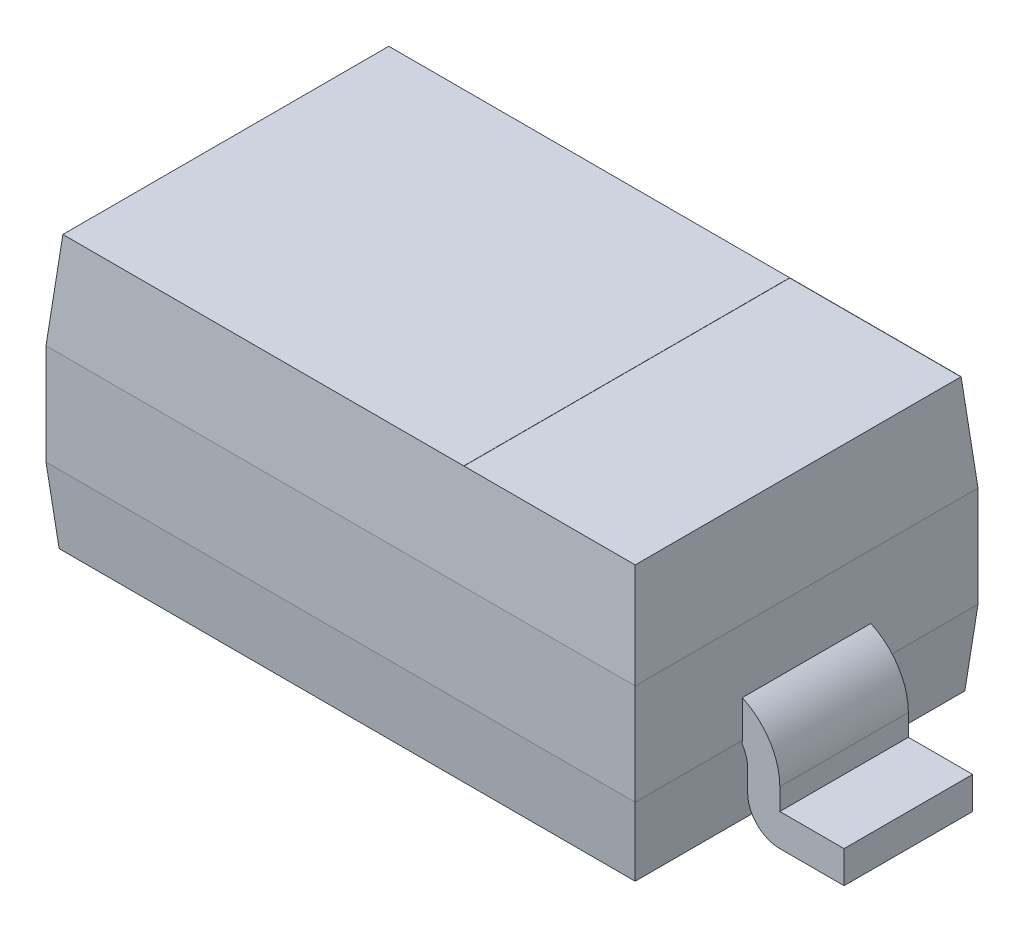
ISO-10303-21;
HEADER;
FILE_DESCRIPTION(('STEP AP214'),'2;1');
FILE_NAME('part.step','',(''),(''),'','','');
FILE_SCHEMA(('AUTOMOTIVE_DESIGN { 1 0 10303 214 1 1 1 1 }'));
ENDSEC;
DATA;
#1=APPLICATION_CONTEXT('core data for automotive mechanical design processes');
#2=APPLICATION_PROTOCOL_DEFINITION('international standard','automotive_design',2000,#1);
#3=PRODUCT_CONTEXT('',#1,'mechanical');
#4=PRODUCT('Part','Part','',(#3));
#5=PRODUCT_RELATED_PRODUCT_CATEGORY('part','',(#4));
#6=PRODUCT_DEFINITION_FORMATION('','',#4);
#7=PRODUCT_DEFINITION_CONTEXT('part definition',#1,'design');
#8=PRODUCT_DEFINITION('design','',#6,#7);
#9=PRODUCT_DEFINITION_SHAPE('','',#8);
#10=(LENGTH_UNIT() NAMED_UNIT(*) SI_UNIT(.MILLI.,.METRE.));
#11=(NAMED_UNIT(*) PLANE_ANGLE_UNIT() SI_UNIT($,.RADIAN.));
#12=(NAMED_UNIT(*) SI_UNIT($,.STERADIAN.) SOLID_ANGLE_UNIT());
#13=UNCERTAINTY_MEASURE_WITH_UNIT(LENGTH_MEASURE(1.E-05),#10,'distance_accuracy_value','');
#14=(GEOMETRIC_REPRESENTATION_CONTEXT(3) GLOBAL_UNCERTAINTY_ASSIGNED_CONTEXT((#13)) GLOBAL_UNIT_ASSIGNED_CONTEXT((#10,
#11,#12)) REPRESENTATION_CONTEXT('',''));
#15=CARTESIAN_POINT('',(0.,0.,0.));
#16=DIRECTION('',(0.,0.,1.));
#17=DIRECTION('',(1.,0.,0.));
#18=AXIS2_PLACEMENT_3D('',#15,#16,#17);
#19=CARTESIAN_POINT('',(1.375,1.27,-0.8));
#20=DIRECTION('',(-1.,0.,0.));
#21=DIRECTION('',(0.,0.,1.));
#22=AXIS2_PLACEMENT_3D('',#19,#20,#21);
#23=PLANE('',#22);
#24=DIRECTION('',(0.,0.,1.));
#25=VECTOR('',#24,1.);
#26=CARTESIAN_POINT('',(1.375,0.522717802866,-0.8));
#27=LINE('',#26,#25);
#28=CARTESIAN_POINT('',(1.375,0.522717802865946,-0.3));
#29=VERTEX_POINT('',#28);
#30=CARTESIAN_POINT('',(1.375,0.522717802865946,0.3));
#31=VERTEX_POINT('',#30);
#32=EDGE_CURVE('E357',#29,#31,#27,.T.);
#33=ORIENTED_EDGE('',*,*,#32,.F.);
#34=DIRECTION('',(0.,1.,0.));
#35=VECTOR('',#34,1.);
#36=CARTESIAN_POINT('',(1.375,1.27,-0.3));
#37=LINE('',#36,#35);
#38=CARTESIAN_POINT('',(1.375,0.35,-0.3));
#39=VERTEX_POINT('',#38);
#40=EDGE_CURVE('E360',#39,#29,#37,.T.);
#41=ORIENTED_EDGE('',*,*,#40,.F.);
#42=DIRECTION('',(0.,0.,1.));
#43=VECTOR('',#42,1.);
#44=CARTESIAN_POINT('',(1.375,0.35,-0.8));
#45=LINE('',#44,#43);
#46=CARTESIAN_POINT('',(1.375,0.35,-0.8));
#47=VERTEX_POINT('',#46);
#48=EDGE_CURVE('E349',#47,#39,#45,.T.);
#49=ORIENTED_EDGE('',*,*,#48,.F.);
#50=DIRECTION('',(0.,1.,0.));
#51=VECTOR('',#50,1.);
#52=CARTESIAN_POINT('',(1.375,1.27,-0.8));
#53=LINE('',#52,#51);
#54=CARTESIAN_POINT('',(1.37499999999983,0.819999999999985,-0.8));
#55=VERTEX_POINT('',#54);
#56=EDGE_CURVE('E346',#55,#47,#53,.F.);
#57=ORIENTED_EDGE('',*,*,#56,.F.);
#58=DIRECTION('',(0.,0.,1.));
#59=VECTOR('',#58,1.);
#60=CARTESIAN_POINT('',(1.37499999999966,0.81999999999997,0.8));
#61=LINE('',#60,#59);
#62=CARTESIAN_POINT('',(1.37499999999983,0.819999999999978,0.8));
#63=VERTEX_POINT('',#62);
#64=EDGE_CURVE('E251',#63,#55,#61,.F.);
#65=ORIENTED_EDGE('',*,*,#64,.F.);
#66=DIRECTION('',(0.,1.,0.));
#67=VECTOR('',#66,1.);
#68=CARTESIAN_POINT('',(1.375,1.27,0.8));
#69=LINE('',#68,#67);
#70=CARTESIAN_POINT('',(1.375,0.35,0.8));
#71=VERTEX_POINT('',#70);
#72=EDGE_CURVE('E350',#71,#63,#69,.T.);
#73=ORIENTED_EDGE('',*,*,#72,.F.);
#74=DIRECTION('',(0.,0.,1.));
#75=VECTOR('',#74,1.);
#76=CARTESIAN_POINT('',(1.375,0.35,-0.8));
#77=LINE('',#76,#75);
#78=CARTESIAN_POINT('',(1.375,0.35,0.3));
#79=VERTEX_POINT('',#78);
#80=EDGE_CURVE('E354',#79,#71,#77,.T.);
#81=ORIENTED_EDGE('',*,*,#80,.F.);
#82=DIRECTION('',(0.,1.,0.));
#83=VECTOR('',#82,1.);
#84=CARTESIAN_POINT('',(1.375,1.27,0.3));
#85=LINE('',#84,#83);
#86=EDGE_CURVE('E252',#31,#79,#85,.F.);
#87=ORIENTED_EDGE('',*,*,#86,.F.);
#88=EDGE_LOOP('',(#33,#41,#49,#57,#65,#73,#81,#87));
#89=FACE_BOUND('',#88,.T.);
#90=ADVANCED_FACE('F17',(#89),#23,.F.);
#91=CARTESIAN_POINT('',(1.335630101413,1.27,0.8));
#92=DIRECTION('',(0.996194698091747,0.0871557427476379,0.));
#93=DIRECTION('',(-0.0871557427476379,0.996194698091747,0.));
#94=AXIS2_PLACEMENT_3D('',#91,#92,#93);
#95=PLANE('',#94);
#96=DIRECTION('',(-0.0868265938642217,0.992432509138906,0.0868265938649735));
#97=VECTOR('',#96,1.);
#98=CARTESIAN_POINT('',(1.37499999999966,0.81999999999997,-0.8));
#99=LINE('',#98,#97);
#100=CARTESIAN_POINT('',(1.335630101413,1.27,-0.760630101413));
#101=VERTEX_POINT('',#100);
#102=EDGE_CURVE('E256',#55,#101,#99,.T.);
#103=ORIENTED_EDGE('',*,*,#102,.T.);
#104=DIRECTION('',(0.,0.,-1.));
#105=VECTOR('',#104,1.);
#106=CARTESIAN_POINT('',(1.335630101413,1.27,0.760630101413));
#107=LINE('',#106,#105);
#108=CARTESIAN_POINT('',(1.335630101413,1.27,0.760630101413));
#109=VERTEX_POINT('',#108);
#110=EDGE_CURVE('E221',#101,#109,#107,.F.);
#111=ORIENTED_EDGE('',*,*,#110,.T.);
#112=DIRECTION('',(0.0868265938642217,-0.992432509138906,0.0868265938649735));
#113=VECTOR('',#112,1.);
#114=CARTESIAN_POINT('',(1.335630101413,1.27,0.760630101413));
#115=LINE('',#114,#113);
#116=EDGE_CURVE('E243',#109,#63,#115,.T.);
#117=ORIENTED_EDGE('',*,*,#116,.T.);
#118=ORIENTED_EDGE('',*,*,#64,.T.);
#119=EDGE_LOOP('',(#103,#111,#117,#118));
#120=FACE_BOUND('',#119,.T.);
#121=ADVANCED_FACE('F254',(#120),#95,.T.);
#122=CARTESIAN_POINT('',(-1.375,1.27,-0.8));
#123=DIRECTION('',(1.,0.,0.));
#124=DIRECTION('',(0.,0.,-1.));
#125=AXIS2_PLACEMENT_3D('',#122,#123,#124);
#126=PLANE('',#125);
#127=DIRECTION('',(0.,0.,-1.));
#128=VECTOR('',#127,1.);
#129=CARTESIAN_POINT('',(-1.375,0.35,-0.8));
#130=LINE('',#129,#128);
#131=CARTESIAN_POINT('',(-1.375,0.35,0.8));
#132=VERTEX_POINT('',#131);
#133=CARTESIAN_POINT('',(-1.375,0.35,0.3));
#134=VERTEX_POINT('',#133);
#135=EDGE_CURVE('E280',#132,#134,#130,.T.);
#136=ORIENTED_EDGE('',*,*,#135,.F.);
#137=DIRECTION('',(0.,1.,0.));
#138=VECTOR('',#137,1.);
#139=CARTESIAN_POINT('',(-1.375,1.27,0.8));
#140=LINE('',#139,#138);
#141=CARTESIAN_POINT('',(-1.37499999999974,0.819999999999985,0.8));
#142=VERTEX_POINT('',#141);
#143=EDGE_CURVE('E277',#142,#132,#140,.F.);
#144=ORIENTED_EDGE('',*,*,#143,.F.);
#145=DIRECTION('',(0.,0.,1.));
#146=VECTOR('',#145,1.);
#147=CARTESIAN_POINT('',(-1.37499999999965,0.81999999999997,0.8));
#148=LINE('',#147,#146);
#149=CARTESIAN_POINT('',(-1.37499999999983,0.819999999999977,-0.8));
#150=VERTEX_POINT('',#149);
#151=EDGE_CURVE('E271',#150,#142,#148,.T.);
#152=ORIENTED_EDGE('',*,*,#151,.F.);
#153=DIRECTION('',(0.,1.,0.));
#154=VECTOR('',#153,1.);
#155=CARTESIAN_POINT('',(-1.375,1.27,-0.8));
#156=LINE('',#155,#154);
#157=CARTESIAN_POINT('',(-1.375,0.35,-0.8));
#158=VERTEX_POINT('',#157);
#159=EDGE_CURVE('E281',#158,#150,#156,.T.);
#160=ORIENTED_EDGE('',*,*,#159,.F.);
#161=DIRECTION('',(0.,0.,-1.));
#162=VECTOR('',#161,1.);
#163=CARTESIAN_POINT('',(-1.375,0.35,-0.8));
#164=LINE('',#163,#162);
#165=CARTESIAN_POINT('',(-1.375,0.35,-0.3));
#166=VERTEX_POINT('',#165);
#167=EDGE_CURVE('E286',#166,#158,#164,.T.);
#168=ORIENTED_EDGE('',*,*,#167,.F.);
#169=DIRECTION('',(0.,1.,0.));
#170=VECTOR('',#169,1.);
#171=CARTESIAN_POINT('',(-1.375,1.27,-0.3));
#172=LINE('',#171,#170);
#173=CARTESIAN_POINT('',(-1.375,0.522717802865946,-0.3));
#174=VERTEX_POINT('',#173);
#175=EDGE_CURVE('E312',#174,#166,#172,.F.);
#176=ORIENTED_EDGE('',*,*,#175,.F.);
#177=DIRECTION('',(0.,0.,-1.));
#178=VECTOR('',#177,1.);
#179=CARTESIAN_POINT('',(-1.375,0.522717802866,-0.8));
#180=LINE('',#179,#178);
#181=CARTESIAN_POINT('',(-1.375,0.522717802865946,0.3));
#182=VERTEX_POINT('',#181);
#183=EDGE_CURVE('E297',#182,#174,#180,.T.);
#184=ORIENTED_EDGE('',*,*,#183,.F.);
#185=DIRECTION('',(0.,1.,0.));
#186=VECTOR('',#185,1.);
#187=CARTESIAN_POINT('',(-1.375,1.27,0.3));
#188=LINE('',#187,#186);
#189=EDGE_CURVE('E229',#134,#182,#188,.T.);
#190=ORIENTED_EDGE('',*,*,#189,.F.);
#191=EDGE_LOOP('',(#136,#144,#152,#160,#168,#176,#184,#190));
#192=FACE_BOUND('',#191,.T.);
#193=ADVANCED_FACE('F627',(#192),#126,.F.);
#194=CARTESIAN_POINT('',(1.335630101413,1.269,0.760630101413));
#195=DIRECTION('',(1.,0.,0.));
#196=DIRECTION('',(0.,0.,-1.));
#197=AXIS2_PLACEMENT_3D('',#194,#195,#196);
#198=PLANE('',#197);
#199=DIRECTION('',(0.,1.,0.));
#200=VECTOR('',#199,1.);
#201=CARTESIAN_POINT('',(1.335630101413,1.269,-0.760630101413));
#202=LINE('',#201,#200);
#203=CARTESIAN_POINT('',(1.335630101413,1.269,-0.760630101413));
#204=VERTEX_POINT('',#203);
#205=EDGE_CURVE('E228',#204,#101,#202,.T.);
#206=ORIENTED_EDGE('',*,*,#205,.F.);
#207=DIRECTION('',(0.,0.,-1.));
#208=VECTOR('',#207,1.);
#209=CARTESIAN_POINT('',(1.335630101413,1.269,0.760630101413));
#210=LINE('',#209,#208);
#211=CARTESIAN_POINT('',(1.335630101413,1.269,0.760630101413));
#212=VERTEX_POINT('',#211);
#213=EDGE_CURVE('E224',#204,#212,#210,.F.);
#214=ORIENTED_EDGE('',*,*,#213,.T.);
#215=DIRECTION('',(0.,1.,0.));
#216=VECTOR('',#215,1.);
#217=CARTESIAN_POINT('',(1.335630101413,1.269,0.760630101413));
#218=LINE('',#217,#216);
#219=EDGE_CURVE('E20',#109,#212,#218,.F.);
#220=ORIENTED_EDGE('',*,*,#219,.F.);
#221=ORIENTED_EDGE('',*,*,#110,.F.);
#222=EDGE_LOOP('',(#206,#214,#220,#221));
#223=FACE_BOUND('',#222,.T.);
#224=ADVANCED_FACE('F219',(#223),#198,.F.);
#225=CARTESIAN_POINT('',(0.535630101413,1.269,0.760630101413));
#226=DIRECTION('',(-1.,0.,0.));
#227=DIRECTION('',(0.,0.,1.));
#228=AXIS2_PLACEMENT_3D('',#225,#226,#227);
#229=PLANE('',#228);
#230=DIRECTION('',(0.,1.,0.));
#231=VECTOR('',#230,1.);
#232=CARTESIAN_POINT('',(0.535630101413,1.269,0.760630101413));
#233=LINE('',#232,#231);
#234=CARTESIAN_POINT('',(0.535630101413,1.27,0.760630101413));
#235=VERTEX_POINT('',#234);
#236=CARTESIAN_POINT('',(0.535630101413,1.269,0.760630101413));
#237=VERTEX_POINT('',#236);
#238=EDGE_CURVE('E235',#235,#237,#233,.F.);
#239=ORIENTED_EDGE('',*,*,#238,.T.);
#240=DIRECTION('',(0.,0.,-1.));
#241=VECTOR('',#240,1.);
#242=CARTESIAN_POINT('',(0.535630101413,1.269,0.760630101413));
#243=LINE('',#242,#241);
#244=CARTESIAN_POINT('',(0.535630101413,1.269,-0.760630101413));
#245=VERTEX_POINT('',#244);
#246=EDGE_CURVE('E431',#237,#245,#243,.T.);
#247=ORIENTED_EDGE('',*,*,#246,.T.);
#248=DIRECTION('',(0.,1.,0.));
#249=VECTOR('',#248,1.);
#250=CARTESIAN_POINT('',(0.535630101413,1.269,-0.760630101413));
#251=LINE('',#250,#249);
#252=CARTESIAN_POINT('',(0.535630101413,1.27,-0.760630101413));
#253=VERTEX_POINT('',#252);
#254=EDGE_CURVE('E258',#253,#245,#251,.F.);
#255=ORIENTED_EDGE('',*,*,#254,.F.);
#256=DIRECTION('',(0.,0.,1.));
#257=VECTOR('',#256,1.);
#258=CARTESIAN_POINT('',(0.535630101413,1.27,0.8));
#259=LINE('',#258,#257);
#260=EDGE_CURVE('E434',#235,#253,#259,.F.);
#261=ORIENTED_EDGE('',*,*,#260,.F.);
#262=EDGE_LOOP('',(#239,#247,#255,#261));
#263=FACE_BOUND('',#262,.T.);
#264=ADVANCED_FACE('F752',(#263),#229,.F.);
#265=CARTESIAN_POINT('',(-1.335630101413,1.27,0.8));
#266=DIRECTION('',(-0.996194698091748,0.087155742747628,0.));
#267=DIRECTION('',(-0.087155742747628,-0.996194698091748,0.));
#268=AXIS2_PLACEMENT_3D('',#265,#266,#267);
#269=PLANE('',#268);
#270=DIRECTION('',(0.0868265938642122,0.992432509138907,-0.0868265938649735));
#271=VECTOR('',#270,1.);
#272=CARTESIAN_POINT('',(-1.37499999999965,0.81999999999997,0.8));
#273=LINE('',#272,#271);
#274=CARTESIAN_POINT('',(-1.335630101413,1.27,0.760630101413));
#275=VERTEX_POINT('',#274);
#276=EDGE_CURVE('E274',#142,#275,#273,.T.);
#277=ORIENTED_EDGE('',*,*,#276,.T.);
#278=DIRECTION('',(0.,0.,1.));
#279=VECTOR('',#278,1.);
#280=CARTESIAN_POINT('',(-1.335630101413,1.27,0.8));
#281=LINE('',#280,#279);
#282=CARTESIAN_POINT('',(-1.335630101413,1.27,-0.760630101413));
#283=VERTEX_POINT('',#282);
#284=EDGE_CURVE('E447',#283,#275,#281,.T.);
#285=ORIENTED_EDGE('',*,*,#284,.F.);
#286=DIRECTION('',(-0.0868265938642122,-0.992432509138907,-0.0868265938649735));
#287=VECTOR('',#286,1.);
#288=CARTESIAN_POINT('',(-1.335630101413,1.27,-0.760630101413));
#289=LINE('',#288,#287);
#290=EDGE_CURVE('E260',#283,#150,#289,.T.);
#291=ORIENTED_EDGE('',*,*,#290,.T.);
#292=ORIENTED_EDGE('',*,*,#151,.T.);
#293=EDGE_LOOP('',(#277,#285,#291,#292));
#294=FACE_BOUND('',#293,.T.);
#295=ADVANCED_FACE('F446',(#294),#269,.T.);
#296=CARTESIAN_POINT('',(0.535630101413,1.269,0.760630101413));
#297=DIRECTION('',(0.,-1.,0.));
#298=DIRECTION('',(0.,0.,-1.));
#299=AXIS2_PLACEMENT_3D('',#296,#297,#298);
#300=PLANE('',#299);
#301=DIRECTION('',(1.,0.,0.));
#302=VECTOR('',#301,1.);
#303=CARTESIAN_POINT('',(0.535630101413,1.269,0.760630101413));
#304=LINE('',#303,#302);
#305=EDGE_CURVE('E430',#237,#212,#304,.T.);
#306=ORIENTED_EDGE('',*,*,#305,.T.);
#307=ORIENTED_EDGE('',*,*,#213,.F.);
#308=DIRECTION('',(-1.,0.,0.));
#309=VECTOR('',#308,1.);
#310=CARTESIAN_POINT('',(0.535630101413,1.269,-0.760630101413));
#311=LINE('',#310,#309);
#312=EDGE_CURVE('E240',#204,#245,#311,.T.);
#313=ORIENTED_EDGE('',*,*,#312,.T.);
#314=ORIENTED_EDGE('',*,*,#246,.F.);
#315=EDGE_LOOP('',(#306,#307,#313,#314));
#316=FACE_BOUND('',#315,.T.);
#317=ADVANCED_FACE('F746',(#316),#300,.F.);
#318=CARTESIAN_POINT('',(0.535630101413,1.269,0.760630101413));
#319=DIRECTION('',(0.,0.,1.));
#320=DIRECTION('',(1.,0.,0.));
#321=AXIS2_PLACEMENT_3D('',#318,#319,#320);
#322=PLANE('',#321);
#323=ORIENTED_EDGE('',*,*,#219,.T.);
#324=ORIENTED_EDGE('',*,*,#305,.F.);
#325=ORIENTED_EDGE('',*,*,#238,.F.);
#326=DIRECTION('',(1.,0.,0.));
#327=VECTOR('',#326,1.);
#328=CARTESIAN_POINT('',(-1.375,1.27,0.760630101413));
#329=LINE('',#328,#327);
#330=EDGE_CURVE('E231',#109,#235,#329,.F.);
#331=ORIENTED_EDGE('',*,*,#330,.F.);
#332=EDGE_LOOP('',(#323,#324,#325,#331));
#333=FACE_BOUND('',#332,.T.);
#334=ADVANCED_FACE('F233',(#333),#322,.F.);
#335=CARTESIAN_POINT('',(-1.375,1.27,0.8));
#336=DIRECTION('',(0.,1.,0.));
#337=DIRECTION('',(0.,0.,1.));
#338=AXIS2_PLACEMENT_3D('',#335,#336,#337);
#339=PLANE('',#338);
#340=ORIENTED_EDGE('',*,*,#284,.T.);
#341=DIRECTION('',(1.,0.,0.));
#342=VECTOR('',#341,1.);
#343=CARTESIAN_POINT('',(-1.375,1.27,0.760630101413));
#344=LINE('',#343,#342);
#345=EDGE_CURVE('E239',#235,#275,#344,.F.);
#346=ORIENTED_EDGE('',*,*,#345,.F.);
#347=ORIENTED_EDGE('',*,*,#260,.T.);
#348=DIRECTION('',(1.,0.,0.));
#349=VECTOR('',#348,1.);
#350=CARTESIAN_POINT('',(-1.375,1.27,-0.760630101413));
#351=LINE('',#350,#349);
#352=EDGE_CURVE('E455',#283,#253,#351,.T.);
#353=ORIENTED_EDGE('',*,*,#352,.F.);
#354=EDGE_LOOP('',(#340,#346,#347,#353));
#355=FACE_BOUND('',#354,.T.);
#356=ADVANCED_FACE('F452',(#355),#339,.T.);
#357=CARTESIAN_POINT('',(0.535630101413,1.269,-0.760630101413));
#358=DIRECTION('',(0.,0.,-1.));
#359=DIRECTION('',(-1.,0.,0.));
#360=AXIS2_PLACEMENT_3D('',#357,#358,#359);
#361=PLANE('',#360);
#362=ORIENTED_EDGE('',*,*,#254,.T.);
#363=ORIENTED_EDGE('',*,*,#312,.F.);
#364=ORIENTED_EDGE('',*,*,#205,.T.);
#365=DIRECTION('',(1.,0.,0.));
#366=VECTOR('',#365,1.);
#367=CARTESIAN_POINT('',(-1.375,1.27,-0.760630101413));
#368=LINE('',#367,#366);
#369=EDGE_CURVE('E467',#253,#101,#368,.T.);
#370=ORIENTED_EDGE('',*,*,#369,.F.);
#371=EDGE_LOOP('',(#362,#363,#364,#370));
#372=FACE_BOUND('',#371,.T.);
#373=ADVANCED_FACE('F738',(#372),#361,.F.);
#374=CARTESIAN_POINT('',(-1.375,1.27,0.760630101413));
#375=DIRECTION('',(0.,0.087155742747628,0.996194698091748));
#376=DIRECTION('',(0.,-0.996194698091748,0.087155742747628));
#377=AXIS2_PLACEMENT_3D('',#374,#375,#376);
#378=PLANE('',#377);
#379=ORIENTED_EDGE('',*,*,#276,.F.);
#380=DIRECTION('',(-1.,0.,0.));
#381=VECTOR('',#380,1.);
#382=CARTESIAN_POINT('',(-1.375,0.82,0.8));
#383=LINE('',#382,#381);
#384=EDGE_CURVE('E247',#142,#63,#383,.F.);
#385=ORIENTED_EDGE('',*,*,#384,.T.);
#386=ORIENTED_EDGE('',*,*,#116,.F.);
#387=ORIENTED_EDGE('',*,*,#330,.T.);
#388=ORIENTED_EDGE('',*,*,#345,.T.);
#389=EDGE_LOOP('',(#379,#385,#386,#387,#388));
#390=FACE_BOUND('',#389,.T.);
#391=ADVANCED_FACE('F245',(#390),#378,.T.);
#392=CARTESIAN_POINT('',(1.55,0.25,0.3));
#393=DIRECTION('',(-1.,0.,0.));
#394=DIRECTION('',(0.,-1.,0.));
#395=AXIS2_PLACEMENT_3D('',#392,#393,#394);
#396=PLANE('',#395);
#397=DIRECTION('',(0.,1.,0.));
#398=VECTOR('',#397,1.);
#399=CARTESIAN_POINT('',(1.55,0.15,-0.3));
#400=LINE('',#399,#398);
#401=CARTESIAN_POINT('',(1.55,0.25,-0.3));
#402=VERTEX_POINT('',#401);
#403=CARTESIAN_POINT('',(1.55,0.15,-0.3));
#404=VERTEX_POINT('',#403);
#405=EDGE_CURVE('E429',#402,#404,#400,.F.);
#406=ORIENTED_EDGE('',*,*,#405,.F.);
#407=DIRECTION('',(0.,0.,-1.));
#408=VECTOR('',#407,1.);
#409=CARTESIAN_POINT('',(1.55,0.25,0.3));
#410=LINE('',#409,#408);
#411=CARTESIAN_POINT('',(1.55,0.25,0.3));
#412=VERTEX_POINT('',#411);
#413=EDGE_CURVE('E505',#412,#402,#410,.T.);
#414=ORIENTED_EDGE('',*,*,#413,.F.);
#415=DIRECTION('',(0.,1.,0.));
#416=VECTOR('',#415,1.);
#417=CARTESIAN_POINT('',(1.55,0.15,0.3));
#418=LINE('',#417,#416);
#419=CARTESIAN_POINT('',(1.55,0.15,0.3));
#420=VERTEX_POINT('',#419);
#421=EDGE_CURVE('E491',#412,#420,#418,.F.);
#422=ORIENTED_EDGE('',*,*,#421,.T.);
#423=DIRECTION('',(0.,0.,1.));
#424=VECTOR('',#423,1.);
#425=CARTESIAN_POINT('',(1.55,0.15,0.3));
#426=LINE('',#425,#424);
#427=EDGE_CURVE('E457',#420,#404,#426,.F.);
#428=ORIENTED_EDGE('',*,*,#427,.T.);
#429=EDGE_LOOP('',(#406,#414,#422,#428));
#430=FACE_BOUND('',#429,.T.);
#431=ADVANCED_FACE('F731',(#430),#396,.F.);
#432=CARTESIAN_POINT('',(1.55,0.15,0.3));
#433=DIRECTION('',(0.,-1.,0.));
#434=DIRECTION('',(1.,0.,0.));
#435=AXIS2_PLACEMENT_3D('',#432,#433,#434);
#436=PLANE('',#435);
#437=DIRECTION('',(-1.,0.,0.));
#438=VECTOR('',#437,1.);
#439=CARTESIAN_POINT('',(-1.55,0.15,-0.3));
#440=LINE('',#439,#438);
#441=CARTESIAN_POINT('',(1.85,0.15,-0.3));
#442=VERTEX_POINT('',#441);
#443=EDGE_CURVE('E477',#404,#442,#440,.F.);
#444=ORIENTED_EDGE('',*,*,#443,.F.);
#445=ORIENTED_EDGE('',*,*,#427,.F.);
#446=DIRECTION('',(-1.,0.,0.));
#447=VECTOR('',#446,1.);
#448=CARTESIAN_POINT('',(-1.55,0.15,0.3));
#449=LINE('',#448,#447);
#450=CARTESIAN_POINT('',(1.85,0.15,0.3));
#451=VERTEX_POINT('',#450);
#452=EDGE_CURVE('E487',#420,#451,#449,.F.);
#453=ORIENTED_EDGE('',*,*,#452,.T.);
#454=DIRECTION('',(0.,0.,1.));
#455=VECTOR('',#454,1.);
#456=CARTESIAN_POINT('',(1.85,0.15,0.3));
#457=LINE('',#456,#455);
#458=EDGE_CURVE('E460',#442,#451,#457,.T.);
#459=ORIENTED_EDGE('',*,*,#458,.F.);
#460=EDGE_LOOP('',(#444,#445,#453,#459));
#461=FACE_BOUND('',#460,.T.);
#462=ADVANCED_FACE('F727',(#461),#436,.F.);
#463=CARTESIAN_POINT('',(1.85,0.15,0.3));
#464=DIRECTION('',(1.,0.,0.));
#465=DIRECTION('',(0.,1.,0.));
#466=AXIS2_PLACEMENT_3D('',#463,#464,#465);
#467=PLANE('',#466);
#468=ORIENTED_EDGE('',*,*,#458,.T.);
#469=DIRECTION('',(0.,1.,0.));
#470=VECTOR('',#469,1.);
#471=CARTESIAN_POINT('',(1.85,0.15,0.3));
#472=LINE('',#471,#470);
#473=CARTESIAN_POINT('',(1.85,0.,0.3));
#474=VERTEX_POINT('',#473);
#475=EDGE_CURVE('E490',#451,#474,#472,.F.);
#476=ORIENTED_EDGE('',*,*,#475,.T.);
#477=DIRECTION('',(0.,0.,1.));
#478=VECTOR('',#477,1.);
#479=CARTESIAN_POINT('',(1.85,0.,0.3));
#480=LINE('',#479,#478);
#481=CARTESIAN_POINT('',(1.85,0.,-0.3));
#482=VERTEX_POINT('',#481);
#483=EDGE_CURVE('E495',#482,#474,#480,.T.);
#484=ORIENTED_EDGE('',*,*,#483,.F.);
#485=DIRECTION('',(0.,1.,0.));
#486=VECTOR('',#485,1.);
#487=CARTESIAN_POINT('',(1.85,0.15,-0.3));
#488=LINE('',#487,#486);
#489=EDGE_CURVE('E479',#442,#482,#488,.F.);
#490=ORIENTED_EDGE('',*,*,#489,.F.);
#491=EDGE_LOOP('',(#468,#476,#484,#490));
#492=FACE_BOUND('',#491,.T.);
#493=ADVANCED_FACE('F723',(#492),#467,.T.);
#494=CARTESIAN_POINT('',(1.55,0.,0.3));
#495=DIRECTION('',(0.,-1.,0.));
#496=DIRECTION('',(1.,0.,0.));
#497=AXIS2_PLACEMENT_3D('',#494,#495,#496);
#498=PLANE('',#497);
#499=ORIENTED_EDGE('',*,*,#483,.T.);
#500=DIRECTION('',(-1.,0.,0.));
#501=VECTOR('',#500,1.);
#502=CARTESIAN_POINT('',(-1.55,0.,0.3));
#503=LINE('',#502,#501);
#504=CARTESIAN_POINT('',(1.55,0.,0.3));
#505=VERTEX_POINT('',#504);
#506=EDGE_CURVE('E422',#474,#505,#503,.T.);
#507=ORIENTED_EDGE('',*,*,#506,.T.);
#508=DIRECTION('',(0.,0.,-1.));
#509=VECTOR('',#508,1.);
#510=CARTESIAN_POINT('',(1.55,0.,0.3));
#511=LINE('',#510,#509);
#512=CARTESIAN_POINT('',(1.55,0.,-0.3));
#513=VERTEX_POINT('',#512);
#514=EDGE_CURVE('E503',#513,#505,#511,.F.);
#515=ORIENTED_EDGE('',*,*,#514,.F.);
#516=DIRECTION('',(-1.,0.,0.));
#517=VECTOR('',#516,1.);
#518=CARTESIAN_POINT('',(-1.55,0.,-0.3));
#519=LINE('',#518,#517);
#520=EDGE_CURVE('E426',#482,#513,#519,.T.);
#521=ORIENTED_EDGE('',*,*,#520,.F.);
#522=EDGE_LOOP('',(#499,#507,#515,#521));
#523=FACE_BOUND('',#522,.T.);
#524=ADVANCED_FACE('F719',(#523),#498,.T.);
#525=CARTESIAN_POINT('',(1.55,0.15,0.3));
#526=DIRECTION('',(0.,0.,-1.));
#527=DIRECTION('',(-1.,0.,0.));
#528=AXIS2_PLACEMENT_3D('',#525,#526,#527);
#529=CYLINDRICAL_SURFACE('',#528,0.15);
#530=ORIENTED_EDGE('',*,*,#514,.T.);
#531=CARTESIAN_POINT('',(1.55,0.15,0.3));
#532=DIRECTION('',(0.,0.,-1.));
#533=DIRECTION('',(-1.,0.,0.));
#534=AXIS2_PLACEMENT_3D('',#531,#532,#533);
#535=CIRCLE('',#534,0.15);
#536=CARTESIAN_POINT('',(1.4,0.15,0.3));
#537=VERTEX_POINT('',#536);
#538=EDGE_CURVE('E419',#505,#537,#535,.T.);
#539=ORIENTED_EDGE('',*,*,#538,.T.);
#540=DIRECTION('',(0.,0.,1.));
#541=VECTOR('',#540,1.);
#542=CARTESIAN_POINT('',(1.4,0.15,0.3));
#543=LINE('',#542,#541);
#544=CARTESIAN_POINT('',(1.4,0.15,-0.3));
#545=VERTEX_POINT('',#544);
#546=EDGE_CURVE('E473',#545,#537,#543,.T.);
#547=ORIENTED_EDGE('',*,*,#546,.F.);
#548=CARTESIAN_POINT('',(1.55,0.15,-0.3));
#549=DIRECTION('',(0.,0.,-1.));
#550=DIRECTION('',(-1.,0.,0.));
#551=AXIS2_PLACEMENT_3D('',#548,#549,#550);
#552=CIRCLE('',#551,0.15);
#553=EDGE_CURVE('E423',#513,#545,#552,.T.);
#554=ORIENTED_EDGE('',*,*,#553,.F.);
#555=EDGE_LOOP('',(#530,#539,#547,#554));
#556=FACE_BOUND('',#555,.T.);
#557=ADVANCED_FACE('F715',(#556),#529,.T.);
#558=CARTESIAN_POINT('',(1.25,0.25,0.3));
#559=DIRECTION('',(0.,0.,-1.));
#560=DIRECTION('',(-1.,0.,0.));
#561=AXIS2_PLACEMENT_3D('',#558,#559,#560);
#562=CYLINDRICAL_SURFACE('',#561,0.3);
#563=CARTESIAN_POINT('',(1.25,0.25,0.3));
#564=DIRECTION('',(0.,0.,-1.));
#565=DIRECTION('',(-1.,0.,0.));
#566=AXIS2_PLACEMENT_3D('',#563,#564,#565);
#567=CIRCLE('',#566,0.3);
#568=EDGE_CURVE('E415',#31,#412,#567,.T.);
#569=ORIENTED_EDGE('',*,*,#568,.T.);
#570=ORIENTED_EDGE('',*,*,#413,.T.);
#571=CARTESIAN_POINT('',(1.25,0.25,-0.3));
#572=DIRECTION('',(0.,0.,-1.));
#573=DIRECTION('',(-1.,0.,0.));
#574=AXIS2_PLACEMENT_3D('',#571,#572,#573);
#575=CIRCLE('',#574,0.3);
#576=EDGE_CURVE('E267',#29,#402,#575,.T.);
#577=ORIENTED_EDGE('',*,*,#576,.F.);
#578=ORIENTED_EDGE('',*,*,#32,.T.);
#579=EDGE_LOOP('',(#569,#570,#577,#578));
#580=FACE_BOUND('',#579,.T.);
#581=ADVANCED_FACE('F711',(#580),#562,.T.);
#582=CARTESIAN_POINT('',(1.4,0.25,0.3));
#583=DIRECTION('',(-1.,0.,0.));
#584=DIRECTION('',(0.,-1.,0.));
#585=AXIS2_PLACEMENT_3D('',#582,#583,#584);
#586=PLANE('',#585);
#587=ORIENTED_EDGE('',*,*,#546,.T.);
#588=DIRECTION('',(0.,1.,0.));
#589=VECTOR('',#588,1.);
#590=CARTESIAN_POINT('',(1.4,0.15,0.3));
#591=LINE('',#590,#589);
#592=CARTESIAN_POINT('',(1.4,0.25,0.3));
#593=VERTEX_POINT('',#592);
#594=EDGE_CURVE('E418',#537,#593,#591,.T.);
#595=ORIENTED_EDGE('',*,*,#594,.T.);
#596=DIRECTION('',(0.,0.,-1.));
#597=VECTOR('',#596,1.);
#598=CARTESIAN_POINT('',(1.4,0.25,0.3));
#599=LINE('',#598,#597);
#600=CARTESIAN_POINT('',(1.4,0.25,-0.3));
#601=VERTEX_POINT('',#600);
#602=EDGE_CURVE('E414',#593,#601,#599,.T.);
#603=ORIENTED_EDGE('',*,*,#602,.T.);
#604=DIRECTION('',(0.,1.,0.));
#605=VECTOR('',#604,1.);
#606=CARTESIAN_POINT('',(1.4,0.15,-0.3));
#607=LINE('',#606,#605);
#608=EDGE_CURVE('E425',#545,#601,#607,.T.);
#609=ORIENTED_EDGE('',*,*,#608,.F.);
#610=EDGE_LOOP('',(#587,#595,#603,#609));
#611=FACE_BOUND('',#610,.T.);
#612=ADVANCED_FACE('F707',(#611),#586,.T.);
#613=CARTESIAN_POINT('',(-1.375,1.27,-0.760630101413));
#614=DIRECTION('',(0.,0.087155742747628,-0.996194698091748));
#615=DIRECTION('',(0.,0.996194698091748,0.087155742747628));
#616=AXIS2_PLACEMENT_3D('',#613,#614,#615);
#617=PLANE('',#616);
#618=ORIENTED_EDGE('',*,*,#352,.T.);
#619=ORIENTED_EDGE('',*,*,#369,.T.);
#620=ORIENTED_EDGE('',*,*,#102,.F.);
#621=DIRECTION('',(1.,0.,0.));
#622=VECTOR('',#621,1.);
#623=CARTESIAN_POINT('',(-1.375,0.82,-0.8));
#624=LINE('',#623,#622);
#625=EDGE_CURVE('E289',#55,#150,#624,.F.);
#626=ORIENTED_EDGE('',*,*,#625,.T.);
#627=ORIENTED_EDGE('',*,*,#290,.F.);
#628=EDGE_LOOP('',(#618,#619,#620,#626,#627));
#629=FACE_BOUND('',#628,.T.);
#630=ADVANCED_FACE('F703',(#629),#617,.T.);
#631=CARTESIAN_POINT('',(-1.4,0.25,0.3));
#632=DIRECTION('',(1.,0.,0.));
#633=DIRECTION('',(0.,1.,0.));
#634=AXIS2_PLACEMENT_3D('',#631,#632,#633);
#635=PLANE('',#634);
#636=DIRECTION('',(0.,0.,-1.));
#637=VECTOR('',#636,1.);
#638=CARTESIAN_POINT('',(-1.4,0.25,0.3));
#639=LINE('',#638,#637);
#640=CARTESIAN_POINT('',(-1.4,0.25,-0.3));
#641=VERTEX_POINT('',#640);
#642=CARTESIAN_POINT('',(-1.4,0.25,0.3));
#643=VERTEX_POINT('',#642);
#644=EDGE_CURVE('E401',#641,#643,#639,.F.);
#645=ORIENTED_EDGE('',*,*,#644,.T.);
#646=DIRECTION('',(0.,1.,0.));
#647=VECTOR('',#646,1.);
#648=CARTESIAN_POINT('',(-1.4,0.15,0.3));
#649=LINE('',#648,#647);
#650=CARTESIAN_POINT('',(-1.4,0.15,0.3));
#651=VERTEX_POINT('',#650);
#652=EDGE_CURVE('E394',#643,#651,#649,.F.);
#653=ORIENTED_EDGE('',*,*,#652,.T.);
#654=DIRECTION('',(0.,0.,-1.));
#655=VECTOR('',#654,1.);
#656=CARTESIAN_POINT('',(-1.4,0.15,0.3));
#657=LINE('',#656,#655);
#658=CARTESIAN_POINT('',(-1.4,0.15,-0.3));
#659=VERTEX_POINT('',#658);
#660=EDGE_CURVE('E469',#659,#651,#657,.F.);
#661=ORIENTED_EDGE('',*,*,#660,.F.);
#662=DIRECTION('',(0.,1.,0.));
#663=VECTOR('',#662,1.);
#664=CARTESIAN_POINT('',(-1.4,0.15,-0.3));
#665=LINE('',#664,#663);
#666=EDGE_CURVE('E292',#641,#659,#665,.F.);
#667=ORIENTED_EDGE('',*,*,#666,.F.);
#668=EDGE_LOOP('',(#645,#653,#661,#667));
#669=FACE_BOUND('',#668,.T.);
#670=ADVANCED_FACE('F699',(#669),#635,.T.);
#671=CARTESIAN_POINT('',(-1.55,0.15,0.3));
#672=DIRECTION('',(0.,0.,-1.));
#673=DIRECTION('',(-1.,0.,0.));
#674=AXIS2_PLACEMENT_3D('',#671,#672,#673);
#675=CYLINDRICAL_SURFACE('',#674,0.15);
#676=ORIENTED_EDGE('',*,*,#660,.T.);
#677=CARTESIAN_POINT('',(-1.55,0.15,0.3));
#678=DIRECTION('',(0.,0.,-1.));
#679=DIRECTION('',(-1.,0.,0.));
#680=AXIS2_PLACEMENT_3D('',#677,#678,#679);
#681=CIRCLE('',#680,0.15);
#682=CARTESIAN_POINT('',(-1.55,0.,0.3));
#683=VERTEX_POINT('',#682);
#684=EDGE_CURVE('E390',#651,#683,#681,.T.);
#685=ORIENTED_EDGE('',*,*,#684,.T.);
#686=DIRECTION('',(0.,0.,1.));
#687=VECTOR('',#686,1.);
#688=CARTESIAN_POINT('',(-1.55,0.,0.3));
#689=LINE('',#688,#687);
#690=CARTESIAN_POINT('',(-1.55,0.,-0.3));
#691=VERTEX_POINT('',#690);
#692=EDGE_CURVE('E520',#691,#683,#689,.T.);
#693=ORIENTED_EDGE('',*,*,#692,.F.);
#694=CARTESIAN_POINT('',(-1.55,0.15,-0.3));
#695=DIRECTION('',(0.,0.,-1.));
#696=DIRECTION('',(-1.,0.,0.));
#697=AXIS2_PLACEMENT_3D('',#694,#695,#696);
#698=CIRCLE('',#697,0.15);
#699=EDGE_CURVE('E406',#659,#691,#698,.T.);
#700=ORIENTED_EDGE('',*,*,#699,.F.);
#701=EDGE_LOOP('',(#676,#685,#693,#700));
#702=FACE_BOUND('',#701,.T.);
#703=ADVANCED_FACE('F695',(#702),#675,.T.);
#704=CARTESIAN_POINT('',(-1.55,0.,0.3));
#705=DIRECTION('',(0.,-1.,0.));
#706=DIRECTION('',(1.,0.,0.));
#707=AXIS2_PLACEMENT_3D('',#704,#705,#706);
#708=PLANE('',#707);
#709=ORIENTED_EDGE('',*,*,#692,.T.);
#710=DIRECTION('',(-1.,0.,0.));
#711=VECTOR('',#710,1.);
#712=CARTESIAN_POINT('',(-1.55,0.,0.3));
#713=LINE('',#712,#711);
#714=CARTESIAN_POINT('',(-1.85,0.,0.3));
#715=VERTEX_POINT('',#714);
#716=EDGE_CURVE('E393',#683,#715,#713,.T.);
#717=ORIENTED_EDGE('',*,*,#716,.T.);
#718=DIRECTION('',(0.,0.,1.));
#719=VECTOR('',#718,1.);
#720=CARTESIAN_POINT('',(-1.85,0.,0.3));
#721=LINE('',#720,#719);
#722=CARTESIAN_POINT('',(-1.85,0.,-0.3));
#723=VERTEX_POINT('',#722);
#724=EDGE_CURVE('E522',#723,#715,#721,.T.);
#725=ORIENTED_EDGE('',*,*,#724,.F.);
#726=DIRECTION('',(-1.,0.,0.));
#727=VECTOR('',#726,1.);
#728=CARTESIAN_POINT('',(-1.55,0.,-0.3));
#729=LINE('',#728,#727);
#730=EDGE_CURVE('E408',#691,#723,#729,.T.);
#731=ORIENTED_EDGE('',*,*,#730,.F.);
#732=EDGE_LOOP('',(#709,#717,#725,#731));
#733=FACE_BOUND('',#732,.T.);
#734=ADVANCED_FACE('F691',(#733),#708,.T.);
#735=CARTESIAN_POINT('',(-1.85,0.,0.3));
#736=DIRECTION('',(-1.,0.,0.));
#737=DIRECTION('',(0.,-1.,0.));
#738=AXIS2_PLACEMENT_3D('',#735,#736,#737);
#739=PLANE('',#738);
#740=ORIENTED_EDGE('',*,*,#724,.T.);
#741=DIRECTION('',(0.,1.,0.));
#742=VECTOR('',#741,1.);
#743=CARTESIAN_POINT('',(-1.85,0.15,0.3));
#744=LINE('',#743,#742);
#745=CARTESIAN_POINT('',(-1.85,0.15,0.3));
#746=VERTEX_POINT('',#745);
#747=EDGE_CURVE('E529',#715,#746,#744,.T.);
#748=ORIENTED_EDGE('',*,*,#747,.T.);
#749=DIRECTION('',(0.,0.,1.));
#750=VECTOR('',#749,1.);
#751=CARTESIAN_POINT('',(-1.85,0.149999999999999,0.3));
#752=LINE('',#751,#750);
#753=CARTESIAN_POINT('',(-1.85,0.15,-0.3));
#754=VERTEX_POINT('',#753);
#755=EDGE_CURVE('E526',#746,#754,#752,.F.);
#756=ORIENTED_EDGE('',*,*,#755,.T.);
#757=DIRECTION('',(0.,1.,0.));
#758=VECTOR('',#757,1.);
#759=CARTESIAN_POINT('',(-1.85,0.15,-0.3));
#760=LINE('',#759,#758);
#761=EDGE_CURVE('E512',#723,#754,#760,.T.);
#762=ORIENTED_EDGE('',*,*,#761,.F.);
#763=EDGE_LOOP('',(#740,#748,#756,#762));
#764=FACE_BOUND('',#763,.T.);
#765=ADVANCED_FACE('F687',(#764),#739,.T.);
#766=CARTESIAN_POINT('',(-1.55,0.15,0.3));
#767=DIRECTION('',(0.,-1.,0.));
#768=DIRECTION('',(1.,0.,0.));
#769=AXIS2_PLACEMENT_3D('',#766,#767,#768);
#770=PLANE('',#769);
#771=DIRECTION('',(-1.,0.,0.));
#772=VECTOR('',#771,1.);
#773=CARTESIAN_POINT('',(-1.55,0.15,-0.3));
#774=LINE('',#773,#772);
#775=CARTESIAN_POINT('',(-1.55,0.15,-0.3));
#776=VERTEX_POINT('',#775);
#777=EDGE_CURVE('E514',#754,#776,#774,.F.);
#778=ORIENTED_EDGE('',*,*,#777,.F.);
#779=ORIENTED_EDGE('',*,*,#755,.F.);
#780=DIRECTION('',(-1.,0.,0.));
#781=VECTOR('',#780,1.);
#782=CARTESIAN_POINT('',(-1.55,0.15,0.3));
#783=LINE('',#782,#781);
#784=CARTESIAN_POINT('',(-1.55,0.15,0.3));
#785=VERTEX_POINT('',#784);
#786=EDGE_CURVE('E532',#746,#785,#783,.F.);
#787=ORIENTED_EDGE('',*,*,#786,.T.);
#788=DIRECTION('',(0.,0.,1.));
#789=VECTOR('',#788,1.);
#790=CARTESIAN_POINT('',(-1.55,0.15,0.3));
#791=LINE('',#790,#789);
#792=EDGE_CURVE('E537',#785,#776,#791,.F.);
#793=ORIENTED_EDGE('',*,*,#792,.T.);
#794=EDGE_LOOP('',(#778,#779,#787,#793));
#795=FACE_BOUND('',#794,.T.);
#796=ADVANCED_FACE('F683',(#795),#770,.F.);
#797=CARTESIAN_POINT('',(-1.55,0.25,0.3));
#798=DIRECTION('',(1.,0.,0.));
#799=DIRECTION('',(0.,1.,0.));
#800=AXIS2_PLACEMENT_3D('',#797,#798,#799);
#801=PLANE('',#800);
#802=DIRECTION('',(0.,1.,0.));
#803=VECTOR('',#802,1.);
#804=CARTESIAN_POINT('',(-1.55,0.15,-0.3));
#805=LINE('',#804,#803);
#806=CARTESIAN_POINT('',(-1.55,0.25,-0.3));
#807=VERTEX_POINT('',#806);
#808=EDGE_CURVE('E405',#776,#807,#805,.T.);
#809=ORIENTED_EDGE('',*,*,#808,.F.);
#810=ORIENTED_EDGE('',*,*,#792,.F.);
#811=DIRECTION('',(0.,1.,0.));
#812=VECTOR('',#811,1.);
#813=CARTESIAN_POINT('',(-1.55,0.15,0.3));
#814=LINE('',#813,#812);
#815=CARTESIAN_POINT('',(-1.55,0.25,0.3));
#816=VERTEX_POINT('',#815);
#817=EDGE_CURVE('E389',#785,#816,#814,.T.);
#818=ORIENTED_EDGE('',*,*,#817,.T.);
#819=DIRECTION('',(0.,0.,-1.));
#820=VECTOR('',#819,1.);
#821=CARTESIAN_POINT('',(-1.55,0.25,0.3));
#822=LINE('',#821,#820);
#823=EDGE_CURVE('E268',#807,#816,#822,.F.);
#824=ORIENTED_EDGE('',*,*,#823,.F.);
#825=EDGE_LOOP('',(#809,#810,#818,#824));
#826=FACE_BOUND('',#825,.T.);
#827=ADVANCED_FACE('F679',(#826),#801,.F.);
#828=CARTESIAN_POINT('',(-1.25,0.25,0.3));
#829=DIRECTION('',(0.,0.,-1.));
#830=DIRECTION('',(-1.,0.,0.));
#831=AXIS2_PLACEMENT_3D('',#828,#829,#830);
#832=CYLINDRICAL_SURFACE('',#831,0.3);
#833=CARTESIAN_POINT('',(-1.25,0.25,-0.3));
#834=DIRECTION('',(0.,0.,-1.));
#835=DIRECTION('',(-1.,0.,0.));
#836=AXIS2_PLACEMENT_3D('',#833,#834,#835);
#837=CIRCLE('',#836,0.3);
#838=EDGE_CURVE('E402',#807,#174,#837,.T.);
#839=ORIENTED_EDGE('',*,*,#838,.F.);
#840=ORIENTED_EDGE('',*,*,#823,.T.);
#841=CARTESIAN_POINT('',(-1.25,0.25,0.3));
#842=DIRECTION('',(0.,0.,-1.));
#843=DIRECTION('',(-1.,0.,0.));
#844=AXIS2_PLACEMENT_3D('',#841,#842,#843);
#845=CIRCLE('',#844,0.3);
#846=EDGE_CURVE('E323',#816,#182,#845,.T.);
#847=ORIENTED_EDGE('',*,*,#846,.T.);
#848=ORIENTED_EDGE('',*,*,#183,.T.);
#849=EDGE_LOOP('',(#839,#840,#847,#848));
#850=FACE_BOUND('',#849,.T.);
#851=ADVANCED_FACE('F676',(#850),#832,.T.);
#852=CARTESIAN_POINT('',(-1.375,1.27,0.8));
#853=DIRECTION('',(0.,0.,-1.));
#854=DIRECTION('',(-1.,0.,0.));
#855=AXIS2_PLACEMENT_3D('',#852,#853,#854);
#856=PLANE('',#855);
#857=DIRECTION('',(1.,0.,0.));
#858=VECTOR('',#857,1.);
#859=CARTESIAN_POINT('',(-1.375,0.35,0.8));
#860=LINE('',#859,#858);
#861=EDGE_CURVE('E319',#132,#71,#860,.T.);
#862=ORIENTED_EDGE('',*,*,#861,.T.);
#863=ORIENTED_EDGE('',*,*,#72,.T.);
#864=ORIENTED_EDGE('',*,*,#384,.F.);
#865=ORIENTED_EDGE('',*,*,#143,.T.);
#866=EDGE_LOOP('',(#862,#863,#864,#865));
#867=FACE_BOUND('',#866,.T.);
#868=ADVANCED_FACE('F624',(#867),#856,.F.);
#869=CARTESIAN_POINT('',(-1.55,0.15,-0.3));
#870=DIRECTION('',(0.,0.,-1.));
#871=DIRECTION('',(-1.,0.,0.));
#872=AXIS2_PLACEMENT_3D('',#869,#870,#871);
#873=PLANE('',#872);
#874=CARTESIAN_POINT('',(1.25,0.25,-0.3));
#875=DIRECTION('',(0.,0.,-1.));
#876=DIRECTION('',(-1.,0.,0.));
#877=AXIS2_PLACEMENT_3D('',#874,#875,#876);
#878=CIRCLE('',#877,0.15);
#879=CARTESIAN_POINT('',(1.37367687103118,0.33487656668311,-0.3));
#880=VERTEX_POINT('',#879);
#881=EDGE_CURVE('E411',#601,#880,#878,.F.);
#882=ORIENTED_EDGE('',*,*,#881,.T.);
#883=DIRECTION('',(-0.0871557427476379,-0.996194698091747,0.));
#884=VECTOR('',#883,1.);
#885=CARTESIAN_POINT('',(1.375,0.35,-0.3));
#886=LINE('',#885,#884);
#887=EDGE_CURVE('E322',#880,#39,#886,.F.);
#888=ORIENTED_EDGE('',*,*,#887,.T.);
#889=ORIENTED_EDGE('',*,*,#40,.T.);
#890=ORIENTED_EDGE('',*,*,#576,.T.);
#891=ORIENTED_EDGE('',*,*,#405,.T.);
#892=ORIENTED_EDGE('',*,*,#443,.T.);
#893=ORIENTED_EDGE('',*,*,#489,.T.);
#894=ORIENTED_EDGE('',*,*,#520,.T.);
#895=ORIENTED_EDGE('',*,*,#553,.T.);
#896=ORIENTED_EDGE('',*,*,#608,.T.);
#897=EDGE_LOOP('',(#882,#888,#889,#890,#891,#892,#893,#894,#895,#896));
#898=FACE_BOUND('',#897,.T.);
#899=ADVANCED_FACE('F669',(#898),#873,.T.);
#900=CARTESIAN_POINT('',(-1.55,0.15,0.3));
#901=DIRECTION('',(0.,0.,-1.));
#902=DIRECTION('',(-1.,0.,0.));
#903=AXIS2_PLACEMENT_3D('',#900,#901,#902);
#904=PLANE('',#903);
#905=ORIENTED_EDGE('',*,*,#86,.T.);
#906=DIRECTION('',(-0.0871557427476379,-0.996194698091747,0.));
#907=VECTOR('',#906,1.);
#908=CARTESIAN_POINT('',(1.375,0.35,0.3));
#909=LINE('',#908,#907);
#910=CARTESIAN_POINT('',(1.37367687103118,0.33487656668311,0.3));
#911=VERTEX_POINT('',#910);
#912=EDGE_CURVE('E384',#79,#911,#909,.T.);
#913=ORIENTED_EDGE('',*,*,#912,.T.);
#914=CARTESIAN_POINT('',(1.25,0.25,0.3));
#915=DIRECTION('',(0.,0.,-1.));
#916=DIRECTION('',(-1.,0.,0.));
#917=AXIS2_PLACEMENT_3D('',#914,#915,#916);
#918=CIRCLE('',#917,0.15);
#919=EDGE_CURVE('E293',#911,#593,#918,.T.);
#920=ORIENTED_EDGE('',*,*,#919,.T.);
#921=ORIENTED_EDGE('',*,*,#594,.F.);
#922=ORIENTED_EDGE('',*,*,#538,.F.);
#923=ORIENTED_EDGE('',*,*,#506,.F.);
#924=ORIENTED_EDGE('',*,*,#475,.F.);
#925=ORIENTED_EDGE('',*,*,#452,.F.);
#926=ORIENTED_EDGE('',*,*,#421,.F.);
#927=ORIENTED_EDGE('',*,*,#568,.F.);
#928=EDGE_LOOP('',(#905,#913,#920,#921,#922,#923,#924,#925,#926,#927));
#929=FACE_BOUND('',#928,.T.);
#930=ADVANCED_FACE('F665',(#929),#904,.F.);
#931=CARTESIAN_POINT('',(1.25,0.25,0.3));
#932=DIRECTION('',(0.,0.,-1.));
#933=DIRECTION('',(-1.,0.,0.));
#934=AXIS2_PLACEMENT_3D('',#931,#932,#933);
#935=CYLINDRICAL_SURFACE('',#934,0.15);
#936=DIRECTION('',(0.,0.,1.));
#937=VECTOR('',#936,1.);
#938=CARTESIAN_POINT('',(1.37367687103117,0.334876566682985,-0.8));
#939=LINE('',#938,#937);
#940=EDGE_CURVE('E333',#911,#880,#939,.F.);
#941=ORIENTED_EDGE('',*,*,#940,.T.);
#942=ORIENTED_EDGE('',*,*,#881,.F.);
#943=ORIENTED_EDGE('',*,*,#602,.F.);
#944=ORIENTED_EDGE('',*,*,#919,.F.);
#945=EDGE_LOOP('',(#941,#942,#943,#944));
#946=FACE_BOUND('',#945,.T.);
#947=ADVANCED_FACE('F661',(#946),#935,.F.);
#948=CARTESIAN_POINT('',(-1.375,1.27,-0.8));
#949=DIRECTION('',(0.,0.,1.));
#950=DIRECTION('',(1.,0.,0.));
#951=AXIS2_PLACEMENT_3D('',#948,#949,#950);
#952=PLANE('',#951);
#953=DIRECTION('',(1.,0.,0.));
#954=VECTOR('',#953,1.);
#955=CARTESIAN_POINT('',(-1.375,0.35,-0.8));
#956=LINE('',#955,#954);
#957=EDGE_CURVE('E330',#47,#158,#956,.F.);
#958=ORIENTED_EDGE('',*,*,#957,.T.);
#959=ORIENTED_EDGE('',*,*,#159,.T.);
#960=ORIENTED_EDGE('',*,*,#625,.F.);
#961=ORIENTED_EDGE('',*,*,#56,.T.);
#962=EDGE_LOOP('',(#958,#959,#960,#961));
#963=FACE_BOUND('',#962,.T.);
#964=ADVANCED_FACE('F657',(#963),#952,.F.);
#965=CARTESIAN_POINT('',(-1.55,0.15,-0.3));
#966=DIRECTION('',(0.,0.,-1.));
#967=DIRECTION('',(-1.,0.,0.));
#968=AXIS2_PLACEMENT_3D('',#965,#966,#967);
#969=PLANE('',#968);
#970=ORIENTED_EDGE('',*,*,#808,.T.);
#971=ORIENTED_EDGE('',*,*,#838,.T.);
#972=ORIENTED_EDGE('',*,*,#175,.T.);
#973=DIRECTION('',(-0.087155742747628,0.996194698091748,0.));
#974=VECTOR('',#973,1.);
#975=CARTESIAN_POINT('',(-1.375,0.35,-0.3));
#976=LINE('',#975,#974);
#977=CARTESIAN_POINT('',(-1.37367687103118,0.33487656668311,-0.3));
#978=VERTEX_POINT('',#977);
#979=EDGE_CURVE('E327',#166,#978,#976,.F.);
#980=ORIENTED_EDGE('',*,*,#979,.T.);
#981=CARTESIAN_POINT('',(-1.25,0.25,-0.3));
#982=DIRECTION('',(0.,0.,-1.));
#983=DIRECTION('',(-1.,0.,0.));
#984=AXIS2_PLACEMENT_3D('',#981,#982,#983);
#985=CIRCLE('',#984,0.15);
#986=EDGE_CURVE('E398',#978,#641,#985,.F.);
#987=ORIENTED_EDGE('',*,*,#986,.T.);
#988=ORIENTED_EDGE('',*,*,#666,.T.);
#989=ORIENTED_EDGE('',*,*,#699,.T.);
#990=ORIENTED_EDGE('',*,*,#730,.T.);
#991=ORIENTED_EDGE('',*,*,#761,.T.);
#992=ORIENTED_EDGE('',*,*,#777,.T.);
#993=EDGE_LOOP('',(#970,#971,#972,#980,#987,#988,#989,#990,#991,#992));
#994=FACE_BOUND('',#993,.T.);
#995=ADVANCED_FACE('F653',(#994),#969,.T.);
#996=CARTESIAN_POINT('',(-1.25,0.25,0.3));
#997=DIRECTION('',(0.,0.,-1.));
#998=DIRECTION('',(-1.,0.,0.));
#999=AXIS2_PLACEMENT_3D('',#996,#997,#998);
#1000=CYLINDRICAL_SURFACE('',#999,0.15);
#1001=DIRECTION('',(0.,0.,1.));
#1002=VECTOR('',#1001,1.);
#1003=CARTESIAN_POINT('',(-1.37367687103117,0.334876566682985,-0.8));
#1004=LINE('',#1003,#1002);
#1005=CARTESIAN_POINT('',(-1.37367687103118,0.33487656668311,0.3));
#1006=VERTEX_POINT('',#1005);
#1007=EDGE_CURVE('E585',#978,#1006,#1004,.T.);
#1008=ORIENTED_EDGE('',*,*,#1007,.T.);
#1009=CARTESIAN_POINT('',(-1.25,0.25,0.3));
#1010=DIRECTION('',(0.,0.,-1.));
#1011=DIRECTION('',(-1.,0.,0.));
#1012=AXIS2_PLACEMENT_3D('',#1009,#1010,#1011);
#1013=CIRCLE('',#1012,0.15);
#1014=EDGE_CURVE('E395',#1006,#643,#1013,.F.);
#1015=ORIENTED_EDGE('',*,*,#1014,.T.);
#1016=ORIENTED_EDGE('',*,*,#644,.F.);
#1017=ORIENTED_EDGE('',*,*,#986,.F.);
#1018=EDGE_LOOP('',(#1008,#1015,#1016,#1017));
#1019=FACE_BOUND('',#1018,.T.);
#1020=ADVANCED_FACE('F649',(#1019),#1000,.F.);
#1021=CARTESIAN_POINT('',(-1.55,0.15,0.3));
#1022=DIRECTION('',(0.,0.,-1.));
#1023=DIRECTION('',(-1.,0.,0.));
#1024=AXIS2_PLACEMENT_3D('',#1021,#1022,#1023);
#1025=PLANE('',#1024);
#1026=ORIENTED_EDGE('',*,*,#189,.T.);
#1027=ORIENTED_EDGE('',*,*,#846,.F.);
#1028=ORIENTED_EDGE('',*,*,#817,.F.);
#1029=ORIENTED_EDGE('',*,*,#786,.F.);
#1030=ORIENTED_EDGE('',*,*,#747,.F.);
#1031=ORIENTED_EDGE('',*,*,#716,.F.);
#1032=ORIENTED_EDGE('',*,*,#684,.F.);
#1033=ORIENTED_EDGE('',*,*,#652,.F.);
#1034=ORIENTED_EDGE('',*,*,#1014,.F.);
#1035=DIRECTION('',(-0.087155742747628,0.996194698091748,0.));
#1036=VECTOR('',#1035,1.);
#1037=CARTESIAN_POINT('',(-1.375,0.35,0.3));
#1038=LINE('',#1037,#1036);
#1039=EDGE_CURVE('E588',#1006,#134,#1038,.T.);
#1040=ORIENTED_EDGE('',*,*,#1039,.T.);
#1041=EDGE_LOOP('',(#1026,#1027,#1028,#1029,#1030,#1031,#1032,#1033,#1034,#1040));
#1042=FACE_BOUND('',#1041,.T.);
#1043=ADVANCED_FACE('F646',(#1042),#1025,.F.);
#1044=CARTESIAN_POINT('',(-1.375,0.35,0.8));
#1045=DIRECTION('',(0.,0.087155742747628,-0.996194698091748));
#1046=DIRECTION('',(0.,0.996194698091748,0.087155742747628));
#1047=AXIS2_PLACEMENT_3D('',#1044,#1045,#1046);
#1048=PLANE('',#1047);
#1049=DIRECTION('',(1.,0.,0.));
#1050=VECTOR('',#1049,1.);
#1051=CARTESIAN_POINT('',(-1.375,0.,0.769378967766));
#1052=LINE('',#1051,#1050);
#1053=CARTESIAN_POINT('',(-1.34437896776598,0.,0.769378967765969));
#1054=VERTEX_POINT('',#1053);
#1055=CARTESIAN_POINT('',(1.34437896776598,0.,0.769378967765969));
#1056=VERTEX_POINT('',#1055);
#1057=EDGE_CURVE('E591',#1054,#1056,#1052,.T.);
#1058=ORIENTED_EDGE('',*,*,#1057,.T.);
#1059=DIRECTION('',(0.0868265938642288,0.992432509138987,0.0868265938640425));
#1060=VECTOR('',#1059,1.);
#1061=CARTESIAN_POINT('',(1.34437896776593,0.,0.769378967766));
#1062=LINE('',#1061,#1060);
#1063=EDGE_CURVE('E381',#1056,#71,#1062,.T.);
#1064=ORIENTED_EDGE('',*,*,#1063,.T.);
#1065=ORIENTED_EDGE('',*,*,#861,.F.);
#1066=DIRECTION('',(0.086826593864219,-0.992432509138988,-0.0868265938640425));
#1067=VECTOR('',#1066,1.);
#1068=CARTESIAN_POINT('',(-1.375,0.35,0.8));
#1069=LINE('',#1068,#1067);
#1070=EDGE_CURVE('E313',#132,#1054,#1069,.T.);
#1071=ORIENTED_EDGE('',*,*,#1070,.T.);
#1072=EDGE_LOOP('',(#1058,#1064,#1065,#1071));
#1073=FACE_BOUND('',#1072,.T.);
#1074=ADVANCED_FACE('F622',(#1073),#1048,.F.);
#1075=CARTESIAN_POINT('',(1.375,0.35,-0.8));
#1076=DIRECTION('',(-0.996194698091747,0.0871557427476379,0.));
#1077=DIRECTION('',(-0.0871557427476379,-0.996194698091747,0.));
#1078=AXIS2_PLACEMENT_3D('',#1075,#1076,#1077);
#1079=PLANE('',#1078);
#1080=ORIENTED_EDGE('',*,*,#912,.F.);
#1081=ORIENTED_EDGE('',*,*,#80,.T.);
#1082=ORIENTED_EDGE('',*,*,#1063,.F.);
#1083=DIRECTION('',(0.,0.,1.));
#1084=VECTOR('',#1083,1.);
#1085=CARTESIAN_POINT('',(1.344378967766,0.,0.8));
#1086=LINE('',#1085,#1084);
#1087=CARTESIAN_POINT('',(1.34437896776597,0.,-0.769378967765985));
#1088=VERTEX_POINT('',#1087);
#1089=EDGE_CURVE('E606',#1056,#1088,#1086,.F.);
#1090=ORIENTED_EDGE('',*,*,#1089,.T.);
#1091=DIRECTION('',(0.0868265938640425,0.992432509138988,-0.086826593864219));
#1092=VECTOR('',#1091,1.);
#1093=CARTESIAN_POINT('',(1.344378967766,0.,-0.769378967765938));
#1094=LINE('',#1093,#1092);
#1095=EDGE_CURVE('E316',#1088,#47,#1094,.T.);
#1096=ORIENTED_EDGE('',*,*,#1095,.T.);
#1097=ORIENTED_EDGE('',*,*,#48,.T.);
#1098=ORIENTED_EDGE('',*,*,#887,.F.);
#1099=ORIENTED_EDGE('',*,*,#940,.F.);
#1100=EDGE_LOOP('',(#1080,#1081,#1082,#1090,#1096,#1097,#1098,#1099));
#1101=FACE_BOUND('',#1100,.T.);
#1102=ADVANCED_FACE('F619',(#1101),#1079,.F.);
#1103=CARTESIAN_POINT('',(-1.375,0.35,-0.8));
#1104=DIRECTION('',(0.,0.087155742747628,0.996194698091748));
#1105=DIRECTION('',(0.,-0.996194698091748,0.087155742747628));
#1106=AXIS2_PLACEMENT_3D('',#1103,#1104,#1105);
#1107=PLANE('',#1106);
#1108=DIRECTION('',(1.,0.,0.));
#1109=VECTOR('',#1108,1.);
#1110=CARTESIAN_POINT('',(-1.375,0.,-0.769378967766));
#1111=LINE('',#1110,#1109);
#1112=CARTESIAN_POINT('',(-1.34437896776598,0.,-0.769378967765969));
#1113=VERTEX_POINT('',#1112);
#1114=EDGE_CURVE('E26',#1088,#1113,#1111,.F.);
#1115=ORIENTED_EDGE('',*,*,#1114,.T.);
#1116=DIRECTION('',(-0.086826593864219,0.992432509138988,-0.0868265938640425));
#1117=VECTOR('',#1116,1.);
#1118=CARTESIAN_POINT('',(-1.34437896776594,0.,-0.769378967766));
#1119=LINE('',#1118,#1117);
#1120=EDGE_CURVE('E34',#1113,#158,#1119,.T.);
#1121=ORIENTED_EDGE('',*,*,#1120,.T.);
#1122=ORIENTED_EDGE('',*,*,#957,.F.);
#1123=ORIENTED_EDGE('',*,*,#1095,.F.);
#1124=EDGE_LOOP('',(#1115,#1121,#1122,#1123));
#1125=FACE_BOUND('',#1124,.T.);
#1126=ADVANCED_FACE('F612',(#1125),#1107,.F.);
#1127=CARTESIAN_POINT('',(-1.375,0.35,-0.8));
#1128=DIRECTION('',(0.996194698091748,0.087155742747628,0.));
#1129=DIRECTION('',(-0.087155742747628,0.996194698091748,0.));
#1130=AXIS2_PLACEMENT_3D('',#1127,#1128,#1129);
#1131=PLANE('',#1130);
#1132=ORIENTED_EDGE('',*,*,#1039,.F.);
#1133=ORIENTED_EDGE('',*,*,#1007,.F.);
#1134=ORIENTED_EDGE('',*,*,#979,.F.);
#1135=ORIENTED_EDGE('',*,*,#167,.T.);
#1136=ORIENTED_EDGE('',*,*,#1120,.F.);
#1137=DIRECTION('',(0.,0.,1.));
#1138=VECTOR('',#1137,1.);
#1139=CARTESIAN_POINT('',(-1.344378967766,0.,0.8));
#1140=LINE('',#1139,#1138);
#1141=EDGE_CURVE('E11',#1113,#1054,#1140,.T.);
#1142=ORIENTED_EDGE('',*,*,#1141,.T.);
#1143=ORIENTED_EDGE('',*,*,#1070,.F.);
#1144=ORIENTED_EDGE('',*,*,#135,.T.);
#1145=EDGE_LOOP('',(#1132,#1133,#1134,#1135,#1136,#1142,#1143,#1144));
#1146=FACE_BOUND('',#1145,.T.);
#1147=ADVANCED_FACE('F630',(#1146),#1131,.F.);
#1148=CARTESIAN_POINT('',(-1.375,0.,0.8));
#1149=DIRECTION('',(0.,1.,0.));
#1150=DIRECTION('',(0.,0.,1.));
#1151=AXIS2_PLACEMENT_3D('',#1148,#1149,#1150);
#1152=PLANE('',#1151);
#1153=ORIENTED_EDGE('',*,*,#1114,.F.);
#1154=ORIENTED_EDGE('',*,*,#1089,.F.);
#1155=ORIENTED_EDGE('',*,*,#1057,.F.);
#1156=ORIENTED_EDGE('',*,*,#1141,.F.);
#1157=EDGE_LOOP('',(#1153,#1154,#1155,#1156));
#1158=FACE_BOUND('',#1157,.T.);
#1159=ADVANCED_FACE('F616',(#1158),#1152,.F.);
#1160=CLOSED_SHELL('',(#90,#121,#193,#224,#264,#295,#317,#334,#356,#373,#391,#431,#462,#493,
#524,#557,#581,#612,#630,#670,#703,#734,#765,#796,#827,#851,#868,#899,#930,#947,#964,#995,#1020,
#1043,#1074,#1102,#1126,#1147,#1159));
#1161=MANIFOLD_SOLID_BREP('B1',#1160);
#1162=ADVANCED_BREP_SHAPE_REPRESENTATION('',(#18,#1161),#14);
#1163=SHAPE_DEFINITION_REPRESENTATION(#9,#1162);
ENDSEC;
END-ISO-10303-21;
